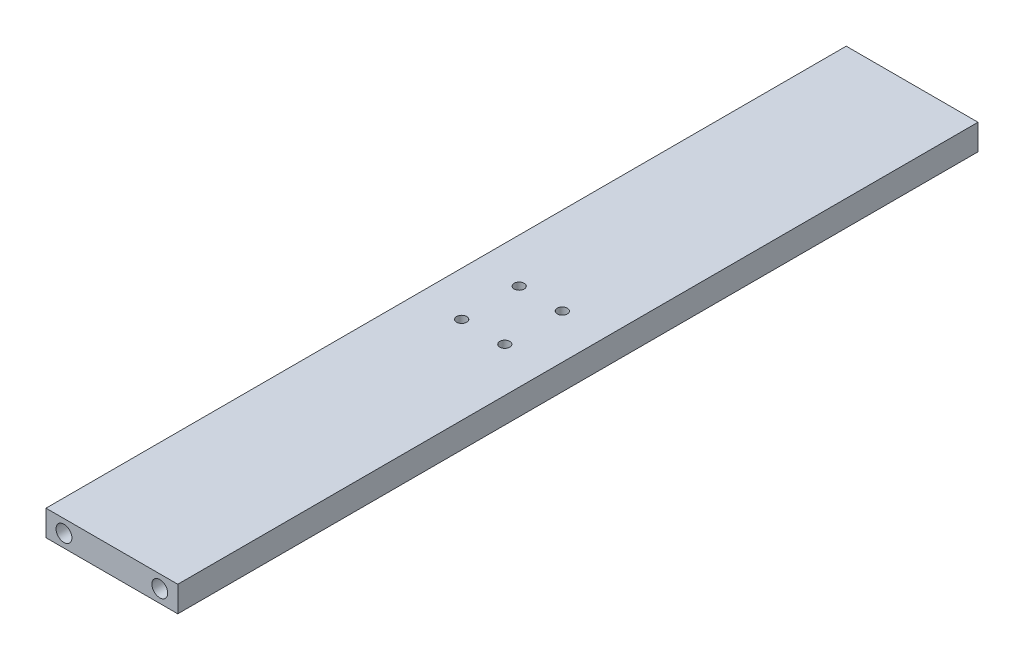
ISO-10303-21;
HEADER;
FILE_DESCRIPTION(('STEP AP214'),'2;1');
FILE_NAME('part.step','',(''),(''),'','','');
FILE_SCHEMA(('AUTOMOTIVE_DESIGN { 1 0 10303 214 1 1 1 1 }'));
ENDSEC;
DATA;
#1=APPLICATION_CONTEXT('core data for automotive mechanical design processes');
#2=APPLICATION_PROTOCOL_DEFINITION('international standard','automotive_design',2000,#1);
#3=PRODUCT_CONTEXT('',#1,'mechanical');
#4=PRODUCT('Part','Part','',(#3));
#5=PRODUCT_RELATED_PRODUCT_CATEGORY('part','',(#4));
#6=PRODUCT_DEFINITION_FORMATION('','',#4);
#7=PRODUCT_DEFINITION_CONTEXT('part definition',#1,'design');
#8=PRODUCT_DEFINITION('design','',#6,#7);
#9=PRODUCT_DEFINITION_SHAPE('','',#8);
#10=(LENGTH_UNIT() NAMED_UNIT(*) SI_UNIT(.MILLI.,.METRE.));
#11=(NAMED_UNIT(*) PLANE_ANGLE_UNIT() SI_UNIT($,.RADIAN.));
#12=(NAMED_UNIT(*) SI_UNIT($,.STERADIAN.) SOLID_ANGLE_UNIT());
#13=UNCERTAINTY_MEASURE_WITH_UNIT(LENGTH_MEASURE(1.E-05),#10,'distance_accuracy_value','');
#14=(GEOMETRIC_REPRESENTATION_CONTEXT(3) GLOBAL_UNCERTAINTY_ASSIGNED_CONTEXT((#13)) GLOBAL_UNIT_ASSIGNED_CONTEXT((#10,
#11,#12)) REPRESENTATION_CONTEXT('',''));
#15=CARTESIAN_POINT('',(0.,0.,0.));
#16=DIRECTION('',(0.,0.,1.));
#17=DIRECTION('',(1.,0.,0.));
#18=AXIS2_PLACEMENT_3D('',#15,#16,#17);
#19=CARTESIAN_POINT('',(-27.5,-5.35,334.));
#20=DIRECTION('',(1.,0.,0.));
#21=DIRECTION('',(0.,0.,-1.));
#22=AXIS2_PLACEMENT_3D('',#19,#20,#21);
#23=PLANE('',#22);
#24=DIRECTION('',(0.,-1.,0.));
#25=VECTOR('',#24,1.);
#26=CARTESIAN_POINT('',(-27.5,-5.35,0.));
#27=LINE('',#26,#25);
#28=CARTESIAN_POINT('',(-27.5,5.35,0.));
#29=VERTEX_POINT('',#28);
#30=CARTESIAN_POINT('',(-27.5,-5.35,0.));
#31=VERTEX_POINT('',#30);
#32=EDGE_CURVE('E156',#29,#31,#27,.T.);
#33=ORIENTED_EDGE('',*,*,#32,.T.);
#34=DIRECTION('',(0.,0.,-1.));
#35=VECTOR('',#34,1.);
#36=CARTESIAN_POINT('',(-27.5,-5.35,334.));
#37=LINE('',#36,#35);
#38=CARTESIAN_POINT('',(-27.5,-5.35,334.));
#39=VERTEX_POINT('',#38);
#40=EDGE_CURVE('E11',#39,#31,#37,.T.);
#41=ORIENTED_EDGE('',*,*,#40,.F.);
#42=DIRECTION('',(0.,-1.,0.));
#43=VECTOR('',#42,1.);
#44=CARTESIAN_POINT('',(-27.5,-5.35,334.));
#45=LINE('',#44,#43);
#46=CARTESIAN_POINT('',(-27.5,5.35,334.));
#47=VERTEX_POINT('',#46);
#48=EDGE_CURVE('E157',#47,#39,#45,.T.);
#49=ORIENTED_EDGE('',*,*,#48,.F.);
#50=DIRECTION('',(0.,0.,-1.));
#51=VECTOR('',#50,1.);
#52=CARTESIAN_POINT('',(-27.5,5.35,334.));
#53=LINE('',#52,#51);
#54=EDGE_CURVE('E163',#47,#29,#53,.T.);
#55=ORIENTED_EDGE('',*,*,#54,.T.);
#56=EDGE_LOOP('',(#33,#41,#49,#55));
#57=FACE_BOUND('',#56,.T.);
#58=ADVANCED_FACE('F39',(#57),#23,.F.);
#59=CARTESIAN_POINT('',(27.5,-5.35,334.));
#60=DIRECTION('',(0.,1.,0.));
#61=DIRECTION('',(-1.,0.,0.));
#62=AXIS2_PLACEMENT_3D('',#59,#60,#61);
#63=PLANE('',#62);
#64=CARTESIAN_POINT('',(-9.,-5.35,155.));
#65=DIRECTION('',(0.,-1.,0.));
#66=DIRECTION('',(0.,0.,-1.));
#67=AXIS2_PLACEMENT_3D('',#64,#65,#66);
#68=CIRCLE('',#67,2.09999999999999);
#69=CARTESIAN_POINT('',(-9.,-5.35,152.9));
#70=VERTEX_POINT('',#69);
#71=EDGE_CURVE('E132',#70,#70,#68,.T.);
#72=ORIENTED_EDGE('',*,*,#71,.F.);
#73=EDGE_LOOP('',(#72));
#74=FACE_BOUND('',#73,.T.);
#75=CARTESIAN_POINT('',(9.,-5.35,155.));
#76=DIRECTION('',(0.,-1.,0.));
#77=DIRECTION('',(0.,0.,-1.));
#78=AXIS2_PLACEMENT_3D('',#75,#76,#77);
#79=CIRCLE('',#78,2.09999999999999);
#80=CARTESIAN_POINT('',(9.,-5.35,152.9));
#81=VERTEX_POINT('',#80);
#82=EDGE_CURVE('E138',#81,#81,#79,.T.);
#83=ORIENTED_EDGE('',*,*,#82,.F.);
#84=EDGE_LOOP('',(#83));
#85=FACE_BOUND('',#84,.T.);
#86=CARTESIAN_POINT('',(9.,-5.35,179.));
#87=DIRECTION('',(0.,-1.,0.));
#88=DIRECTION('',(0.,0.,-1.));
#89=AXIS2_PLACEMENT_3D('',#86,#87,#88);
#90=CIRCLE('',#89,2.09999999999999);
#91=CARTESIAN_POINT('',(9.,-5.35,176.9));
#92=VERTEX_POINT('',#91);
#93=EDGE_CURVE('E144',#92,#92,#90,.T.);
#94=ORIENTED_EDGE('',*,*,#93,.F.);
#95=EDGE_LOOP('',(#94));
#96=FACE_BOUND('',#95,.T.);
#97=CARTESIAN_POINT('',(-9.,-5.35,179.));
#98=DIRECTION('',(0.,-1.,0.));
#99=DIRECTION('',(0.,0.,-1.));
#100=AXIS2_PLACEMENT_3D('',#97,#98,#99);
#101=CIRCLE('',#100,2.09999999999999);
#102=CARTESIAN_POINT('',(-9.,-5.35,176.9));
#103=VERTEX_POINT('',#102);
#104=EDGE_CURVE('E150',#103,#103,#101,.T.);
#105=ORIENTED_EDGE('',*,*,#104,.F.);
#106=EDGE_LOOP('',(#105));
#107=FACE_BOUND('',#106,.T.);
#108=DIRECTION('',(1.,0.,0.));
#109=VECTOR('',#108,1.);
#110=CARTESIAN_POINT('',(27.5,-5.35,0.));
#111=LINE('',#110,#109);
#112=CARTESIAN_POINT('',(27.5,-5.35,0.));
#113=VERTEX_POINT('',#112);
#114=EDGE_CURVE('E166',#31,#113,#111,.T.);
#115=ORIENTED_EDGE('',*,*,#114,.T.);
#116=DIRECTION('',(0.,0.,-1.));
#117=VECTOR('',#116,1.);
#118=CARTESIAN_POINT('',(27.5,-5.35,334.));
#119=LINE('',#118,#117);
#120=CARTESIAN_POINT('',(27.5,-5.35,334.));
#121=VERTEX_POINT('',#120);
#122=EDGE_CURVE('E47',#121,#113,#119,.T.);
#123=ORIENTED_EDGE('',*,*,#122,.F.);
#124=DIRECTION('',(1.,0.,0.));
#125=VECTOR('',#124,1.);
#126=CARTESIAN_POINT('',(27.5,-5.35,334.));
#127=LINE('',#126,#125);
#128=EDGE_CURVE('E86',#39,#121,#127,.T.);
#129=ORIENTED_EDGE('',*,*,#128,.F.);
#130=ORIENTED_EDGE('',*,*,#40,.T.);
#131=EDGE_LOOP('',(#115,#123,#129,#130));
#132=FACE_BOUND('',#131,.T.);
#133=ADVANCED_FACE('F191',(#74,#85,#96,#107,#132),#63,.F.);
#134=CARTESIAN_POINT('',(27.5,-5.35,334.));
#135=DIRECTION('',(-1.,0.,0.));
#136=DIRECTION('',(0.,0.,1.));
#137=AXIS2_PLACEMENT_3D('',#134,#135,#136);
#138=PLANE('',#137);
#139=DIRECTION('',(0.,1.,0.));
#140=VECTOR('',#139,1.);
#141=CARTESIAN_POINT('',(27.5,-5.35,0.));
#142=LINE('',#141,#140);
#143=CARTESIAN_POINT('',(27.5,5.35,0.));
#144=VERTEX_POINT('',#143);
#145=EDGE_CURVE('E73',#113,#144,#142,.T.);
#146=ORIENTED_EDGE('',*,*,#145,.T.);
#147=DIRECTION('',(0.,0.,-1.));
#148=VECTOR('',#147,1.);
#149=CARTESIAN_POINT('',(27.5,5.35,334.));
#150=LINE('',#149,#148);
#151=CARTESIAN_POINT('',(27.5,5.35,334.));
#152=VERTEX_POINT('',#151);
#153=EDGE_CURVE('E171',#152,#144,#150,.T.);
#154=ORIENTED_EDGE('',*,*,#153,.F.);
#155=DIRECTION('',(0.,1.,0.));
#156=VECTOR('',#155,1.);
#157=CARTESIAN_POINT('',(27.5,-5.35,334.));
#158=LINE('',#157,#156);
#159=EDGE_CURVE('E160',#121,#152,#158,.T.);
#160=ORIENTED_EDGE('',*,*,#159,.F.);
#161=ORIENTED_EDGE('',*,*,#122,.T.);
#162=EDGE_LOOP('',(#146,#154,#160,#161));
#163=FACE_BOUND('',#162,.T.);
#164=ADVANCED_FACE('F173',(#163),#138,.F.);
#165=CARTESIAN_POINT('',(27.5,5.35,334.));
#166=DIRECTION('',(0.,-1.,0.));
#167=DIRECTION('',(1.,0.,0.));
#168=AXIS2_PLACEMENT_3D('',#165,#166,#167);
#169=PLANE('',#168);
#170=CARTESIAN_POINT('',(-9.,5.35000000000001,155.));
#171=DIRECTION('',(0.,-1.,0.));
#172=DIRECTION('',(0.,0.,-1.));
#173=AXIS2_PLACEMENT_3D('',#170,#171,#172);
#174=CIRCLE('',#173,2.1);
#175=CARTESIAN_POINT('',(-9.,5.35000000000001,152.9));
#176=VERTEX_POINT('',#175);
#177=EDGE_CURVE('E135',#176,#176,#174,.T.);
#178=ORIENTED_EDGE('',*,*,#177,.T.);
#179=EDGE_LOOP('',(#178));
#180=FACE_BOUND('',#179,.T.);
#181=CARTESIAN_POINT('',(9.,5.35000000000001,155.));
#182=DIRECTION('',(0.,-1.,0.));
#183=DIRECTION('',(0.,0.,-1.));
#184=AXIS2_PLACEMENT_3D('',#181,#182,#183);
#185=CIRCLE('',#184,2.1);
#186=CARTESIAN_POINT('',(9.,5.35000000000001,152.9));
#187=VERTEX_POINT('',#186);
#188=EDGE_CURVE('E141',#187,#187,#185,.T.);
#189=ORIENTED_EDGE('',*,*,#188,.T.);
#190=EDGE_LOOP('',(#189));
#191=FACE_BOUND('',#190,.T.);
#192=CARTESIAN_POINT('',(9.,5.35000000000001,179.));
#193=DIRECTION('',(0.,-1.,0.));
#194=DIRECTION('',(0.,0.,-1.));
#195=AXIS2_PLACEMENT_3D('',#192,#193,#194);
#196=CIRCLE('',#195,2.1);
#197=CARTESIAN_POINT('',(9.,5.35000000000001,176.9));
#198=VERTEX_POINT('',#197);
#199=EDGE_CURVE('E147',#198,#198,#196,.T.);
#200=ORIENTED_EDGE('',*,*,#199,.T.);
#201=EDGE_LOOP('',(#200));
#202=FACE_BOUND('',#201,.T.);
#203=CARTESIAN_POINT('',(-9.,5.35000000000001,179.));
#204=DIRECTION('',(0.,-1.,0.));
#205=DIRECTION('',(0.,0.,-1.));
#206=AXIS2_PLACEMENT_3D('',#203,#204,#205);
#207=CIRCLE('',#206,2.1);
#208=CARTESIAN_POINT('',(-9.,5.35000000000001,176.9));
#209=VERTEX_POINT('',#208);
#210=EDGE_CURVE('E153',#209,#209,#207,.T.);
#211=ORIENTED_EDGE('',*,*,#210,.T.);
#212=EDGE_LOOP('',(#211));
#213=FACE_BOUND('',#212,.T.);
#214=DIRECTION('',(-1.,0.,0.));
#215=VECTOR('',#214,1.);
#216=CARTESIAN_POINT('',(27.5,5.35,0.));
#217=LINE('',#216,#215);
#218=EDGE_CURVE('E79',#144,#29,#217,.T.);
#219=ORIENTED_EDGE('',*,*,#218,.T.);
#220=ORIENTED_EDGE('',*,*,#54,.F.);
#221=DIRECTION('',(-1.,0.,0.));
#222=VECTOR('',#221,1.);
#223=CARTESIAN_POINT('',(27.5,5.35,334.));
#224=LINE('',#223,#222);
#225=EDGE_CURVE('E55',#152,#47,#224,.T.);
#226=ORIENTED_EDGE('',*,*,#225,.F.);
#227=ORIENTED_EDGE('',*,*,#153,.T.);
#228=EDGE_LOOP('',(#219,#220,#226,#227));
#229=FACE_BOUND('',#228,.T.);
#230=ADVANCED_FACE('F180',(#180,#191,#202,#213,#229),#169,.F.);
#231=CARTESIAN_POINT('',(0.,0.,334.));
#232=DIRECTION('',(0.,0.,1.));
#233=DIRECTION('',(1.,0.,0.));
#234=AXIS2_PLACEMENT_3D('',#231,#232,#233);
#235=PLANE('',#234);
#236=CARTESIAN_POINT('',(-20.,0.,334.));
#237=DIRECTION('',(0.,0.,1.));
#238=DIRECTION('',(1.,0.,0.));
#239=AXIS2_PLACEMENT_3D('',#236,#237,#238);
#240=CIRCLE('',#239,3.31469999999999);
#241=CARTESIAN_POINT('',(-16.6853,0.,334.));
#242=VERTEX_POINT('',#241);
#243=EDGE_CURVE('E120',#242,#242,#240,.T.);
#244=ORIENTED_EDGE('',*,*,#243,.F.);
#245=EDGE_LOOP('',(#244));
#246=FACE_BOUND('',#245,.T.);
#247=CARTESIAN_POINT('',(20.,0.,334.));
#248=DIRECTION('',(0.,0.,1.));
#249=DIRECTION('',(1.,0.,0.));
#250=AXIS2_PLACEMENT_3D('',#247,#248,#249);
#251=CIRCLE('',#250,3.31469999999999);
#252=CARTESIAN_POINT('',(23.3147,0.,334.));
#253=VERTEX_POINT('',#252);
#254=EDGE_CURVE('E126',#253,#253,#251,.T.);
#255=ORIENTED_EDGE('',*,*,#254,.F.);
#256=EDGE_LOOP('',(#255));
#257=FACE_BOUND('',#256,.T.);
#258=ORIENTED_EDGE('',*,*,#48,.T.);
#259=ORIENTED_EDGE('',*,*,#128,.T.);
#260=ORIENTED_EDGE('',*,*,#159,.T.);
#261=ORIENTED_EDGE('',*,*,#225,.T.);
#262=EDGE_LOOP('',(#258,#259,#260,#261));
#263=FACE_BOUND('',#262,.T.);
#264=ADVANCED_FACE('F182',(#246,#257,#263),#235,.T.);
#265=CARTESIAN_POINT('',(0.,0.,0.));
#266=DIRECTION('',(0.,0.,1.));
#267=DIRECTION('',(1.,0.,0.));
#268=AXIS2_PLACEMENT_3D('',#265,#266,#267);
#269=PLANE('',#268);
#270=CARTESIAN_POINT('',(20.,0.,0.));
#271=DIRECTION('',(0.,0.,-1.));
#272=DIRECTION('',(-1.,0.,0.));
#273=AXIS2_PLACEMENT_3D('',#270,#271,#272);
#274=CIRCLE('',#273,3.31469999999999);
#275=CARTESIAN_POINT('',(16.6853,0.,0.));
#276=VERTEX_POINT('',#275);
#277=EDGE_CURVE('E110',#276,#276,#274,.T.);
#278=ORIENTED_EDGE('',*,*,#277,.F.);
#279=EDGE_LOOP('',(#278));
#280=FACE_BOUND('',#279,.T.);
#281=CARTESIAN_POINT('',(-20.,0.,0.));
#282=DIRECTION('',(0.,0.,-1.));
#283=DIRECTION('',(-1.,0.,0.));
#284=AXIS2_PLACEMENT_3D('',#281,#282,#283);
#285=CIRCLE('',#284,3.31469999999999);
#286=CARTESIAN_POINT('',(-23.3147,0.,0.));
#287=VERTEX_POINT('',#286);
#288=EDGE_CURVE('E109',#287,#287,#285,.T.);
#289=ORIENTED_EDGE('',*,*,#288,.F.);
#290=EDGE_LOOP('',(#289));
#291=FACE_BOUND('',#290,.T.);
#292=ORIENTED_EDGE('',*,*,#32,.F.);
#293=ORIENTED_EDGE('',*,*,#218,.F.);
#294=ORIENTED_EDGE('',*,*,#145,.F.);
#295=ORIENTED_EDGE('',*,*,#114,.F.);
#296=EDGE_LOOP('',(#292,#293,#294,#295));
#297=FACE_BOUND('',#296,.T.);
#298=ADVANCED_FACE('F176',(#280,#291,#297),#269,.F.);
#299=CARTESIAN_POINT('',(-9.,-5.35,179.));
#300=DIRECTION('',(0.,-1.,0.));
#301=DIRECTION('',(0.,0.,-1.));
#302=AXIS2_PLACEMENT_3D('',#299,#300,#301);
#303=CYLINDRICAL_SURFACE('',#302,2.09999999999999);
#304=ORIENTED_EDGE('',*,*,#210,.F.);
#305=EDGE_LOOP('',(#304));
#306=FACE_BOUND('',#305,.T.);
#307=ORIENTED_EDGE('',*,*,#104,.T.);
#308=EDGE_LOOP('',(#307));
#309=FACE_BOUND('',#308,.T.);
#310=ADVANCED_FACE('F210',(#306,#309),#303,.F.);
#311=CARTESIAN_POINT('',(9.,-5.35,179.));
#312=DIRECTION('',(0.,-1.,0.));
#313=DIRECTION('',(0.,0.,-1.));
#314=AXIS2_PLACEMENT_3D('',#311,#312,#313);
#315=CYLINDRICAL_SURFACE('',#314,2.09999999999999);
#316=ORIENTED_EDGE('',*,*,#199,.F.);
#317=EDGE_LOOP('',(#316));
#318=FACE_BOUND('',#317,.T.);
#319=ORIENTED_EDGE('',*,*,#93,.T.);
#320=EDGE_LOOP('',(#319));
#321=FACE_BOUND('',#320,.T.);
#322=ADVANCED_FACE('F212',(#318,#321),#315,.F.);
#323=CARTESIAN_POINT('',(9.,-5.35,155.));
#324=DIRECTION('',(0.,-1.,0.));
#325=DIRECTION('',(0.,0.,-1.));
#326=AXIS2_PLACEMENT_3D('',#323,#324,#325);
#327=CYLINDRICAL_SURFACE('',#326,2.09999999999999);
#328=ORIENTED_EDGE('',*,*,#188,.F.);
#329=EDGE_LOOP('',(#328));
#330=FACE_BOUND('',#329,.T.);
#331=ORIENTED_EDGE('',*,*,#82,.T.);
#332=EDGE_LOOP('',(#331));
#333=FACE_BOUND('',#332,.T.);
#334=ADVANCED_FACE('F219',(#330,#333),#327,.F.);
#335=CARTESIAN_POINT('',(-9.,-5.35,155.));
#336=DIRECTION('',(0.,-1.,0.));
#337=DIRECTION('',(0.,0.,-1.));
#338=AXIS2_PLACEMENT_3D('',#335,#336,#337);
#339=CYLINDRICAL_SURFACE('',#338,2.09999999999999);
#340=ORIENTED_EDGE('',*,*,#177,.F.);
#341=EDGE_LOOP('',(#340));
#342=FACE_BOUND('',#341,.T.);
#343=ORIENTED_EDGE('',*,*,#71,.T.);
#344=EDGE_LOOP('',(#343));
#345=FACE_BOUND('',#344,.T.);
#346=ADVANCED_FACE('F227',(#342,#345),#339,.F.);
#347=CARTESIAN_POINT('',(20.,0.,319.));
#348=DIRECTION('',(0.,0.,1.));
#349=DIRECTION('',(1.,0.,0.));
#350=AXIS2_PLACEMENT_3D('',#347,#348,#349);
#351=CONICAL_SURFACE('',#350,3.3147,1.02974425867666);
#352=CARTESIAN_POINT('',(20.,0.,317.008327306109));
#353=VERTEX_POINT('',#352);
#354=VERTEX_LOOP('',#353);
#355=FACE_BOUND('',#354,.T.);
#356=CARTESIAN_POINT('',(20.,0.,319.));
#357=DIRECTION('',(0.,0.,1.));
#358=DIRECTION('',(1.,0.,0.));
#359=AXIS2_PLACEMENT_3D('',#356,#357,#358);
#360=CIRCLE('',#359,3.3147);
#361=CARTESIAN_POINT('',(23.3147,0.,319.));
#362=VERTEX_POINT('',#361);
#363=EDGE_CURVE('E129',#362,#362,#360,.T.);
#364=ORIENTED_EDGE('',*,*,#363,.T.);
#365=EDGE_LOOP('',(#364));
#366=FACE_BOUND('',#365,.T.);
#367=ADVANCED_FACE('F231',(#355,#366),#351,.F.);
#368=CARTESIAN_POINT('',(20.,0.,334.));
#369=DIRECTION('',(0.,0.,1.));
#370=DIRECTION('',(1.,0.,0.));
#371=AXIS2_PLACEMENT_3D('',#368,#369,#370);
#372=CYLINDRICAL_SURFACE('',#371,3.31469999999999);
#373=ORIENTED_EDGE('',*,*,#363,.F.);
#374=EDGE_LOOP('',(#373));
#375=FACE_BOUND('',#374,.T.);
#376=ORIENTED_EDGE('',*,*,#254,.T.);
#377=EDGE_LOOP('',(#376));
#378=FACE_BOUND('',#377,.T.);
#379=ADVANCED_FACE('F235',(#375,#378),#372,.F.);
#380=CARTESIAN_POINT('',(-20.,0.,319.));
#381=DIRECTION('',(0.,0.,1.));
#382=DIRECTION('',(1.,0.,0.));
#383=AXIS2_PLACEMENT_3D('',#380,#381,#382);
#384=CONICAL_SURFACE('',#383,3.3147,1.02974425867666);
#385=CARTESIAN_POINT('',(-20.,0.,317.008327306109));
#386=VERTEX_POINT('',#385);
#387=VERTEX_LOOP('',#386);
#388=FACE_BOUND('',#387,.T.);
#389=CARTESIAN_POINT('',(-20.,0.,319.));
#390=DIRECTION('',(0.,0.,1.));
#391=DIRECTION('',(1.,0.,0.));
#392=AXIS2_PLACEMENT_3D('',#389,#390,#391);
#393=CIRCLE('',#392,3.3147);
#394=CARTESIAN_POINT('',(-16.6853,0.,319.));
#395=VERTEX_POINT('',#394);
#396=EDGE_CURVE('E123',#395,#395,#393,.T.);
#397=ORIENTED_EDGE('',*,*,#396,.T.);
#398=EDGE_LOOP('',(#397));
#399=FACE_BOUND('',#398,.T.);
#400=ADVANCED_FACE('F239',(#388,#399),#384,.F.);
#401=CARTESIAN_POINT('',(-20.,0.,334.));
#402=DIRECTION('',(0.,0.,1.));
#403=DIRECTION('',(1.,0.,0.));
#404=AXIS2_PLACEMENT_3D('',#401,#402,#403);
#405=CYLINDRICAL_SURFACE('',#404,3.31469999999999);
#406=ORIENTED_EDGE('',*,*,#396,.F.);
#407=EDGE_LOOP('',(#406));
#408=FACE_BOUND('',#407,.T.);
#409=ORIENTED_EDGE('',*,*,#243,.T.);
#410=EDGE_LOOP('',(#409));
#411=FACE_BOUND('',#410,.T.);
#412=ADVANCED_FACE('F243',(#408,#411),#405,.F.);
#413=CARTESIAN_POINT('',(-20.,0.,15.));
#414=DIRECTION('',(0.,0.,-1.));
#415=DIRECTION('',(-1.,0.,0.));
#416=AXIS2_PLACEMENT_3D('',#413,#414,#415);
#417=CONICAL_SURFACE('',#416,3.31469999999999,1.02974425867665);
#418=CARTESIAN_POINT('',(-20.,0.,16.9916726938907));
#419=VERTEX_POINT('',#418);
#420=VERTEX_LOOP('',#419);
#421=FACE_BOUND('',#420,.T.);
#422=CARTESIAN_POINT('',(-20.,0.,15.));
#423=DIRECTION('',(0.,0.,-1.));
#424=DIRECTION('',(-1.,0.,0.));
#425=AXIS2_PLACEMENT_3D('',#422,#423,#424);
#426=CIRCLE('',#425,3.31469999999999);
#427=CARTESIAN_POINT('',(-23.3147,0.,15.));
#428=VERTEX_POINT('',#427);
#429=EDGE_CURVE('E113',#428,#428,#426,.T.);
#430=ORIENTED_EDGE('',*,*,#429,.T.);
#431=EDGE_LOOP('',(#430));
#432=FACE_BOUND('',#431,.T.);
#433=ADVANCED_FACE('F247',(#421,#432),#417,.F.);
#434=CARTESIAN_POINT('',(-20.,0.,0.));
#435=DIRECTION('',(0.,0.,-1.));
#436=DIRECTION('',(-1.,0.,0.));
#437=AXIS2_PLACEMENT_3D('',#434,#435,#436);
#438=CYLINDRICAL_SURFACE('',#437,3.31469999999999);
#439=ORIENTED_EDGE('',*,*,#429,.F.);
#440=EDGE_LOOP('',(#439));
#441=FACE_BOUND('',#440,.T.);
#442=ORIENTED_EDGE('',*,*,#288,.T.);
#443=EDGE_LOOP('',(#442));
#444=FACE_BOUND('',#443,.T.);
#445=ADVANCED_FACE('F103',(#441,#444),#438,.F.);
#446=CARTESIAN_POINT('',(20.,0.,15.));
#447=DIRECTION('',(0.,0.,-1.));
#448=DIRECTION('',(-1.,0.,0.));
#449=AXIS2_PLACEMENT_3D('',#446,#447,#448);
#450=CONICAL_SURFACE('',#449,3.31469999999999,1.02974425867665);
#451=CARTESIAN_POINT('',(20.,0.,16.9916726938907));
#452=VERTEX_POINT('',#451);
#453=VERTEX_LOOP('',#452);
#454=FACE_BOUND('',#453,.T.);
#455=CARTESIAN_POINT('',(20.,0.,15.));
#456=DIRECTION('',(0.,0.,-1.));
#457=DIRECTION('',(-1.,0.,0.));
#458=AXIS2_PLACEMENT_3D('',#455,#456,#457);
#459=CIRCLE('',#458,3.31469999999999);
#460=CARTESIAN_POINT('',(16.6853,0.,15.));
#461=VERTEX_POINT('',#460);
#462=EDGE_CURVE('E107',#461,#461,#459,.T.);
#463=ORIENTED_EDGE('',*,*,#462,.T.);
#464=EDGE_LOOP('',(#463));
#465=FACE_BOUND('',#464,.T.);
#466=ADVANCED_FACE('F99',(#454,#465),#450,.F.);
#467=CARTESIAN_POINT('',(20.,0.,0.));
#468=DIRECTION('',(0.,0.,-1.));
#469=DIRECTION('',(-1.,0.,0.));
#470=AXIS2_PLACEMENT_3D('',#467,#468,#469);
#471=CYLINDRICAL_SURFACE('',#470,3.31469999999999);
#472=ORIENTED_EDGE('',*,*,#462,.F.);
#473=EDGE_LOOP('',(#472));
#474=FACE_BOUND('',#473,.T.);
#475=ORIENTED_EDGE('',*,*,#277,.T.);
#476=EDGE_LOOP('',(#475));
#477=FACE_BOUND('',#476,.T.);
#478=ADVANCED_FACE('F102',(#474,#477),#471,.F.);
#479=CLOSED_SHELL('',(#58,#133,#164,#230,#264,#298,#310,#322,#334,#346,#367,#379,#400,#412,#433,
#445,#466,#478));
#480=MANIFOLD_SOLID_BREP('B2',#479);
#481=ADVANCED_BREP_SHAPE_REPRESENTATION('',(#18,#480),#14);
#482=SHAPE_DEFINITION_REPRESENTATION(#9,#481);
ENDSEC;
END-ISO-10303-21;
